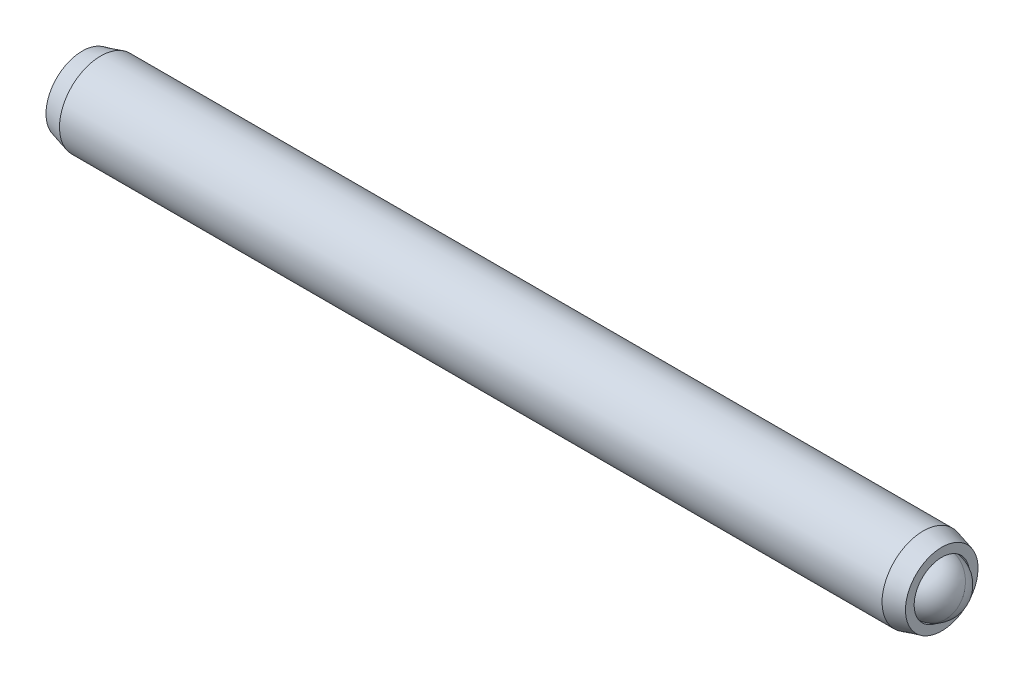
ISO-10303-21;
HEADER;
FILE_DESCRIPTION(('STEP AP214'),'2;1');
FILE_NAME('part.step','',(''),(''),'','','');
FILE_SCHEMA(('AUTOMOTIVE_DESIGN { 1 0 10303 214 1 1 1 1 }'));
ENDSEC;
DATA;
#1=APPLICATION_CONTEXT('core data for automotive mechanical design processes');
#2=APPLICATION_PROTOCOL_DEFINITION('international standard','automotive_design',2000,#1);
#3=PRODUCT_CONTEXT('',#1,'mechanical');
#4=PRODUCT('Part','Part','',(#3));
#5=PRODUCT_RELATED_PRODUCT_CATEGORY('part','',(#4));
#6=PRODUCT_DEFINITION_FORMATION('','',#4);
#7=PRODUCT_DEFINITION_CONTEXT('part definition',#1,'design');
#8=PRODUCT_DEFINITION('design','',#6,#7);
#9=PRODUCT_DEFINITION_SHAPE('','',#8);
#10=(LENGTH_UNIT() NAMED_UNIT(*) SI_UNIT(.MILLI.,.METRE.));
#11=(NAMED_UNIT(*) PLANE_ANGLE_UNIT() SI_UNIT($,.RADIAN.));
#12=(NAMED_UNIT(*) SI_UNIT($,.STERADIAN.) SOLID_ANGLE_UNIT());
#13=UNCERTAINTY_MEASURE_WITH_UNIT(LENGTH_MEASURE(1.E-05),#10,'distance_accuracy_value','');
#14=(GEOMETRIC_REPRESENTATION_CONTEXT(3) GLOBAL_UNCERTAINTY_ASSIGNED_CONTEXT((#13)) GLOBAL_UNIT_ASSIGNED_CONTEXT((#10,
#11,#12)) REPRESENTATION_CONTEXT('',''));
#15=CARTESIAN_POINT('',(0.,0.,0.));
#16=DIRECTION('',(0.,0.,1.));
#17=DIRECTION('',(1.,0.,0.));
#18=AXIS2_PLACEMENT_3D('',#15,#16,#17);
#19=CARTESIAN_POINT('',(-25.4162203856812,1.47543162631791,-0.69225443456844));
#20=DIRECTION('',(-1.,0.,0.));
#21=DIRECTION('',(0.,-1.,0.));
#22=AXIS2_PLACEMENT_3D('',#19,#20,#21);
#23=PLANE('',#22);
#24=DIRECTION('',(0.,0.866025403784438,-0.5));
#25=VECTOR('',#24,1.);
#26=CARTESIAN_POINT('',(-25.4162203856812,1.3484316263179,-2.05790432755285));
#27=LINE('',#26,#25);
#28=CARTESIAN_POINT('',(-25.4162203856812,0.229244126317901,-1.41174112315419));
#29=VERTEX_POINT('',#28);
#30=CARTESIAN_POINT('',(-25.4162203856812,1.47543162631791,-2.13122781173994));
#31=VERTEX_POINT('',#30);
#32=EDGE_CURVE('P0_E164',#29,#31,#27,.T.);
#33=ORIENTED_EDGE('',*,*,#32,.T.);
#34=DIRECTION('',(0.,0.866025403784439,0.5));
#35=VECTOR('',#34,1.);
#36=CARTESIAN_POINT('',(-25.4162203856812,2.59461912631791,-1.48506460734127));
#37=LINE('',#36,#35);
#38=CARTESIAN_POINT('',(-25.4162203856812,2.72161912631791,-1.41174112315419));
#39=VERTEX_POINT('',#38);
#40=EDGE_CURVE('P0_E166',#31,#39,#37,.T.);
#41=ORIENTED_EDGE('',*,*,#40,.T.);
#42=DIRECTION('',(0.,0.,1.));
#43=VECTOR('',#42,1.);
#44=CARTESIAN_POINT('',(-25.4162203856812,2.72161912631791,-0.119414714356858));
#45=LINE('',#44,#43);
#46=CARTESIAN_POINT('',(-25.4162203856812,2.72161912631791,0.0272322540173091));
#47=VERTEX_POINT('',#46);
#48=EDGE_CURVE('P0_E156',#39,#47,#45,.T.);
#49=ORIENTED_EDGE('',*,*,#48,.T.);
#50=DIRECTION('',(0.,-0.866025403784439,0.5));
#51=VECTOR('',#50,1.);
#52=CARTESIAN_POINT('',(-25.4162203856812,1.60243162631791,0.673395458415975));
#53=LINE('',#52,#51);
#54=CARTESIAN_POINT('',(-25.4162203856812,1.47543162631791,0.746718942603059));
#55=VERTEX_POINT('',#54);
#56=EDGE_CURVE('P0_E158',#47,#55,#53,.T.);
#57=ORIENTED_EDGE('',*,*,#56,.T.);
#58=DIRECTION('',(0.,-0.866025403784439,-0.5));
#59=VECTOR('',#58,1.);
#60=CARTESIAN_POINT('',(-25.4162203856812,0.356244126317903,0.100555738204393));
#61=LINE('',#60,#59);
#62=CARTESIAN_POINT('',(-25.4162203856812,0.229244126317901,0.0272322540173094));
#63=VERTEX_POINT('',#62);
#64=EDGE_CURVE('P0_E160',#55,#63,#61,.T.);
#65=ORIENTED_EDGE('',*,*,#64,.T.);
#66=DIRECTION('',(0.,0.,-1.));
#67=VECTOR('',#66,1.);
#68=CARTESIAN_POINT('',(-25.4162203856812,0.229244126317901,-1.26509415478002));
#69=LINE('',#68,#67);
#70=EDGE_CURVE('P0_E162',#63,#29,#69,.T.);
#71=ORIENTED_EDGE('',*,*,#70,.T.);
#72=EDGE_LOOP('',(#33,#41,#49,#57,#65,#71));
#73=FACE_BOUND('',#72,.T.);
#74=CARTESIAN_POINT('',(-25.4162203856812,1.47543162631791,-0.69225443456844));
#75=DIRECTION('',(1.,0.,0.));
#76=DIRECTION('',(0.,1.,0.));
#77=AXIS2_PLACEMENT_3D('',#74,#75,#76);
#78=CIRCLE('',#77,2.0955);
#79=CARTESIAN_POINT('',(-25.4162203856812,3.57093162631791,-0.69225443456844));
#80=VERTEX_POINT('',#79);
#81=EDGE_CURVE('P0_E150',#80,#80,#78,.T.);
#82=ORIENTED_EDGE('',*,*,#81,.F.);
#83=EDGE_LOOP('',(#82));
#84=FACE_BOUND('',#83,.T.);
#85=ADVANCED_FACE('P0_F17',(#73,#84),#23,.T.);
#86=CARTESIAN_POINT('',(-24.3497868674184,1.47543162631791,-0.69225443456844));
#87=DIRECTION('',(1.,0.,0.));
#88=DIRECTION('',(0.,1.,0.));
#89=AXIS2_PLACEMENT_3D('',#86,#87,#88);
#90=CONICAL_SURFACE('',#89,2.38125,0.26179938779915);
#91=ORIENTED_EDGE('',*,*,#81,.T.);
#92=EDGE_LOOP('',(#91));
#93=FACE_BOUND('',#92,.T.);
#94=CARTESIAN_POINT('',(-24.3497868674184,1.47543162631791,-0.69225443456844));
#95=DIRECTION('',(1.,0.,0.));
#96=DIRECTION('',(0.,1.,0.));
#97=AXIS2_PLACEMENT_3D('',#94,#95,#96);
#98=CIRCLE('',#97,2.38125);
#99=CARTESIAN_POINT('',(-24.3497868674184,3.85668162631791,-0.69225443456844));
#100=VERTEX_POINT('',#99);
#101=EDGE_CURVE('P0_E147',#100,#100,#98,.T.);
#102=ORIENTED_EDGE('',*,*,#101,.F.);
#103=EDGE_LOOP('',(#102));
#104=FACE_BOUND('',#103,.T.);
#105=ADVANCED_FACE('P0_F225',(#93,#104),#90,.T.);
#106=CARTESIAN_POINT('',(21.5512155840515,1.47543162631791,-0.69225443456844));
#107=DIRECTION('',(1.,0.,0.));
#108=DIRECTION('',(0.,1.,0.));
#109=AXIS2_PLACEMENT_3D('',#106,#107,#108);
#110=CYLINDRICAL_SURFACE('',#109,2.38125);
#111=ORIENTED_EDGE('',*,*,#101,.T.);
#112=EDGE_LOOP('',(#111));
#113=FACE_BOUND('',#112,.T.);
#114=CARTESIAN_POINT('',(23.174346096056,1.47543162631791,-0.69225443456844));
#115=DIRECTION('',(1.,0.,0.));
#116=DIRECTION('',(0.,1.,0.));
#117=AXIS2_PLACEMENT_3D('',#114,#115,#116);
#118=CIRCLE('',#117,2.38124999999999);
#119=CARTESIAN_POINT('',(23.174346096056,3.85668162631791,-0.69225443456844));
#120=VERTEX_POINT('',#119);
#121=EDGE_CURVE('P0_E144',#120,#120,#118,.T.);
#122=ORIENTED_EDGE('',*,*,#121,.F.);
#123=EDGE_LOOP('',(#122));
#124=FACE_BOUND('',#123,.T.);
#125=ADVANCED_FACE('P0_F231',(#113,#124),#110,.T.);
#126=CARTESIAN_POINT('',(24.2407796143188,1.47543162631791,-0.69225443456844));
#127=DIRECTION('',(-1.,0.,0.));
#128=DIRECTION('',(0.,-1.,0.));
#129=AXIS2_PLACEMENT_3D('',#126,#127,#128);
#130=CONICAL_SURFACE('',#129,2.09549999999999,0.26179938779915);
#131=ORIENTED_EDGE('',*,*,#121,.T.);
#132=EDGE_LOOP('',(#131));
#133=FACE_BOUND('',#132,.T.);
#134=CARTESIAN_POINT('',(24.2407796143188,1.47543162631791,-0.69225443456844));
#135=DIRECTION('',(1.,0.,0.));
#136=DIRECTION('',(0.,1.,0.));
#137=AXIS2_PLACEMENT_3D('',#134,#135,#136);
#138=CIRCLE('',#137,2.09549999999999);
#139=CARTESIAN_POINT('',(24.2407796143188,3.57093162631791,-0.69225443456844));
#140=VERTEX_POINT('',#139);
#141=EDGE_CURVE('P0_E141',#140,#140,#138,.T.);
#142=ORIENTED_EDGE('',*,*,#141,.F.);
#143=EDGE_LOOP('',(#142));
#144=FACE_BOUND('',#143,.T.);
#145=ADVANCED_FACE('P0_F275',(#133,#144),#130,.T.);
#146=CARTESIAN_POINT('',(24.2407796143188,3.57093162631791,-0.69225443456844));
#147=DIRECTION('',(1.,0.,0.));
#148=DIRECTION('',(0.,1.,0.));
#149=AXIS2_PLACEMENT_3D('',#146,#147,#148);
#150=PLANE('',#149);
#151=ORIENTED_EDGE('',*,*,#141,.T.);
#152=EDGE_LOOP('',(#151));
#153=FACE_BOUND('',#152,.T.);
#154=CARTESIAN_POINT('',(24.2407796143188,1.47543162631791,-0.69225443456844));
#155=DIRECTION('',(1.,0.,0.));
#156=DIRECTION('',(0.,1.,0.));
#157=AXIS2_PLACEMENT_3D('',#154,#155,#156);
#158=CIRCLE('',#157,1.59385);
#159=CARTESIAN_POINT('',(24.2407796143188,3.06928162631792,-0.69225443456844));
#160=VERTEX_POINT('',#159);
#161=EDGE_CURVE('P0_E138',#160,#160,#158,.T.);
#162=ORIENTED_EDGE('',*,*,#161,.F.);
#163=EDGE_LOOP('',(#162));
#164=FACE_BOUND('',#163,.T.);
#165=ADVANCED_FACE('P0_F271',(#153,#164),#150,.T.);
#166=CARTESIAN_POINT('',(21.5512155840515,1.47543162631791,-0.69225443456844));
#167=DIRECTION('',(1.,0.,0.));
#168=DIRECTION('',(0.,1.,0.));
#169=AXIS2_PLACEMENT_3D('',#166,#167,#168);
#170=CYLINDRICAL_SURFACE('',#169,1.59385);
#171=ORIENTED_EDGE('',*,*,#161,.T.);
#172=EDGE_LOOP('',(#171));
#173=FACE_BOUND('',#172,.T.);
#174=CARTESIAN_POINT('',(23.1450655840515,1.47543162631791,-0.69225443456844));
#175=DIRECTION('',(1.,0.,0.));
#176=DIRECTION('',(0.,1.,0.));
#177=AXIS2_PLACEMENT_3D('',#174,#175,#176);
#178=CIRCLE('',#177,1.59385);
#179=CARTESIAN_POINT('',(23.1450655840515,3.06928162631792,-0.69225443456844));
#180=VERTEX_POINT('',#179);
#181=EDGE_CURVE('P0_E126',#180,#180,#178,.T.);
#182=ORIENTED_EDGE('',*,*,#181,.F.);
#183=EDGE_LOOP('',(#182));
#184=FACE_BOUND('',#183,.T.);
#185=ADVANCED_FACE('P0_F267',(#173,#184),#170,.F.);
#186=CARTESIAN_POINT('',(21.5512155840515,1.47543162631791,-0.69225443456844));
#187=DIRECTION('',(1.,0.,0.));
#188=DIRECTION('',(0.,1.,0.));
#189=AXIS2_PLACEMENT_3D('',#186,#187,#188);
#190=CONICAL_SURFACE('',#189,0.,0.785398163397451);
#191=ORIENTED_EDGE('',*,*,#181,.T.);
#192=EDGE_LOOP('',(#191));
#193=FACE_BOUND('',#192,.T.);
#194=CARTESIAN_POINT('',(21.5512155840515,1.47543162631791,-0.69225443456844));
#195=VERTEX_POINT('',#194);
#196=VERTEX_LOOP('',#195);
#197=FACE_BOUND('',#196,.T.);
#198=ADVANCED_FACE('P0_F221',(#193,#197),#190,.F.);
#199=CARTESIAN_POINT('',(-22.3682203856812,1.47543162631791,0.453425005854724));
#200=DIRECTION('',(0.,0.5,0.866025403784439));
#201=DIRECTION('',(0.,-0.866025403784439,0.5));
#202=AXIS2_PLACEMENT_3D('',#199,#200,#201);
#203=PLANE('',#202);
#204=DIRECTION('',(-1.,0.,0.));
#205=VECTOR('',#204,1.);
#206=CARTESIAN_POINT('',(-22.3682203856812,1.47543162631791,0.453425005854724));
#207=LINE('',#206,#205);
#208=CARTESIAN_POINT('',(-22.3682203856812,1.47543162631791,0.453425005854724));
#209=VERTEX_POINT('',#208);
#210=CARTESIAN_POINT('',(-25.1622203856812,1.47543162631791,0.453425005854724));
#211=VERTEX_POINT('',#210);
#212=EDGE_CURVE('P0_E124',#209,#211,#207,.T.);
#213=ORIENTED_EDGE('',*,*,#212,.T.);
#214=DIRECTION('',(0.,0.866025403784439,-0.5));
#215=VECTOR('',#214,1.);
#216=CARTESIAN_POINT('',(-25.1622203856812,2.46761912631791,-0.119414714356858));
#217=LINE('',#216,#215);
#218=CARTESIAN_POINT('',(-25.1622203856812,2.46761912631791,-0.119414714356858));
#219=VERTEX_POINT('',#218);
#220=EDGE_CURVE('P0_E26',#211,#219,#217,.T.);
#221=ORIENTED_EDGE('',*,*,#220,.T.);
#222=DIRECTION('',(-1.,0.,0.));
#223=VECTOR('',#222,1.);
#224=CARTESIAN_POINT('',(-22.3682203856812,2.46761912631791,-0.119414714356858));
#225=LINE('',#224,#223);
#226=CARTESIAN_POINT('',(-22.3682203856812,2.46761912631791,-0.119414714356858));
#227=VERTEX_POINT('',#226);
#228=EDGE_CURVE('P0_E90',#227,#219,#225,.T.);
#229=ORIENTED_EDGE('',*,*,#228,.F.);
#230=DIRECTION('',(0.,0.866025403784439,-0.5));
#231=VECTOR('',#230,1.);
#232=CARTESIAN_POINT('',(-22.3682203856812,1.47543162631791,0.453425005854724));
#233=LINE('',#232,#231);
#234=EDGE_CURVE('P0_E94',#209,#227,#233,.T.);
#235=ORIENTED_EDGE('',*,*,#234,.F.);
#236=EDGE_LOOP('',(#213,#221,#229,#235));
#237=FACE_BOUND('',#236,.T.);
#238=ADVANCED_FACE('P0_F92',(#237),#203,.F.);
#239=CARTESIAN_POINT('',(-22.3682203856812,0.483244126317905,-0.119414714356858));
#240=DIRECTION('',(0.,-0.5,0.866025403784439));
#241=DIRECTION('',(0.,-0.866025403784439,-0.5));
#242=AXIS2_PLACEMENT_3D('',#239,#240,#241);
#243=PLANE('',#242);
#244=DIRECTION('',(-1.,0.,0.));
#245=VECTOR('',#244,1.);
#246=CARTESIAN_POINT('',(-22.3682203856812,0.483244126317905,-0.119414714356858));
#247=LINE('',#246,#245);
#248=CARTESIAN_POINT('',(-22.3682203856812,0.483244126317905,-0.119414714356858));
#249=VERTEX_POINT('',#248);
#250=CARTESIAN_POINT('',(-25.1622203856812,0.483244126317905,-0.119414714356858));
#251=VERTEX_POINT('',#250);
#252=EDGE_CURVE('P0_E127',#249,#251,#247,.T.);
#253=ORIENTED_EDGE('',*,*,#252,.T.);
#254=DIRECTION('',(0.,0.866025403784439,0.5));
#255=VECTOR('',#254,1.);
#256=CARTESIAN_POINT('',(-25.1622203856812,1.47543162631791,0.453425005854724));
#257=LINE('',#256,#255);
#258=EDGE_CURVE('P0_E41',#251,#211,#257,.T.);
#259=ORIENTED_EDGE('',*,*,#258,.T.);
#260=ORIENTED_EDGE('',*,*,#212,.F.);
#261=DIRECTION('',(0.,0.866025403784439,0.5));
#262=VECTOR('',#261,1.);
#263=CARTESIAN_POINT('',(-22.3682203856812,0.483244126317905,-0.119414714356858));
#264=LINE('',#263,#262);
#265=EDGE_CURVE('P0_E99',#249,#209,#264,.T.);
#266=ORIENTED_EDGE('',*,*,#265,.F.);
#267=EDGE_LOOP('',(#253,#259,#260,#266));
#268=FACE_BOUND('',#267,.T.);
#269=ADVANCED_FACE('P0_F212',(#268),#243,.F.);
#270=CARTESIAN_POINT('',(-22.3682203856812,0.483244126317905,-1.26509415478002));
#271=DIRECTION('',(0.,-1.,0.));
#272=DIRECTION('',(0.,0.,-1.));
#273=AXIS2_PLACEMENT_3D('',#270,#271,#272);
#274=PLANE('',#273);
#275=DIRECTION('',(-1.,0.,0.));
#276=VECTOR('',#275,1.);
#277=CARTESIAN_POINT('',(-22.3682203856812,0.483244126317905,-1.26509415478002));
#278=LINE('',#277,#276);
#279=CARTESIAN_POINT('',(-22.3682203856812,0.483244126317905,-1.26509415478002));
#280=VERTEX_POINT('',#279);
#281=CARTESIAN_POINT('',(-25.1622203856812,0.483244126317905,-1.26509415478002));
#282=VERTEX_POINT('',#281);
#283=EDGE_CURVE('P0_E129',#280,#282,#278,.T.);
#284=ORIENTED_EDGE('',*,*,#283,.T.);
#285=DIRECTION('',(0.,0.,1.));
#286=VECTOR('',#285,1.);
#287=CARTESIAN_POINT('',(-25.1622203856812,0.483244126317905,-0.119414714356858));
#288=LINE('',#287,#286);
#289=EDGE_CURVE('P0_E171',#282,#251,#288,.T.);
#290=ORIENTED_EDGE('',*,*,#289,.T.);
#291=ORIENTED_EDGE('',*,*,#252,.F.);
#292=DIRECTION('',(0.,0.,1.));
#293=VECTOR('',#292,1.);
#294=CARTESIAN_POINT('',(-22.3682203856812,0.483244126317905,-1.26509415478002));
#295=LINE('',#294,#293);
#296=EDGE_CURVE('P0_E121',#280,#249,#295,.T.);
#297=ORIENTED_EDGE('',*,*,#296,.F.);
#298=EDGE_LOOP('',(#284,#290,#291,#297));
#299=FACE_BOUND('',#298,.T.);
#300=ADVANCED_FACE('P0_F211',(#299),#274,.F.);
#301=CARTESIAN_POINT('',(-22.3682203856812,1.47543162631791,-1.8379338749916));
#302=DIRECTION('',(0.,-0.5,-0.866025403784438));
#303=DIRECTION('',(0.,0.866025403784439,-0.5));
#304=AXIS2_PLACEMENT_3D('',#301,#302,#303);
#305=PLANE('',#304);
#306=DIRECTION('',(-1.,0.,0.));
#307=VECTOR('',#306,1.);
#308=CARTESIAN_POINT('',(-22.3682203856812,1.47543162631791,-1.8379338749916));
#309=LINE('',#308,#307);
#310=CARTESIAN_POINT('',(-22.3682203856812,1.47543162631791,-1.8379338749916));
#311=VERTEX_POINT('',#310);
#312=CARTESIAN_POINT('',(-25.1622203856812,1.47543162631791,-1.8379338749916));
#313=VERTEX_POINT('',#312);
#314=EDGE_CURVE('P0_E132',#311,#313,#309,.T.);
#315=ORIENTED_EDGE('',*,*,#314,.T.);
#316=DIRECTION('',(0.,-0.866025403784439,0.5));
#317=VECTOR('',#316,1.);
#318=CARTESIAN_POINT('',(-25.1622203856812,0.483244126317905,-1.26509415478002));
#319=LINE('',#318,#317);
#320=EDGE_CURVE('P0_E169',#313,#282,#319,.T.);
#321=ORIENTED_EDGE('',*,*,#320,.T.);
#322=ORIENTED_EDGE('',*,*,#283,.F.);
#323=DIRECTION('',(0.,-0.866025403784438,0.5));
#324=VECTOR('',#323,1.);
#325=CARTESIAN_POINT('',(-22.3682203856812,1.47543162631791,-1.8379338749916));
#326=LINE('',#325,#324);
#327=EDGE_CURVE('P0_E118',#311,#280,#326,.T.);
#328=ORIENTED_EDGE('',*,*,#327,.F.);
#329=EDGE_LOOP('',(#315,#321,#322,#328));
#330=FACE_BOUND('',#329,.T.);
#331=ADVANCED_FACE('P0_F208',(#330),#305,.F.);
#332=CARTESIAN_POINT('',(-22.3682203856812,2.46761912631791,-1.26509415478002));
#333=DIRECTION('',(0.,0.5,-0.866025403784439));
#334=DIRECTION('',(0.,0.866025403784439,0.5));
#335=AXIS2_PLACEMENT_3D('',#332,#333,#334);
#336=PLANE('',#335);
#337=DIRECTION('',(-1.,0.,0.));
#338=VECTOR('',#337,1.);
#339=CARTESIAN_POINT('',(-22.3682203856812,2.46761912631791,-1.26509415478002));
#340=LINE('',#339,#338);
#341=CARTESIAN_POINT('',(-22.3682203856812,2.46761912631791,-1.26509415478002));
#342=VERTEX_POINT('',#341);
#343=CARTESIAN_POINT('',(-25.1622203856812,2.46761912631791,-1.26509415478002));
#344=VERTEX_POINT('',#343);
#345=EDGE_CURVE('P0_E98',#342,#344,#340,.T.);
#346=ORIENTED_EDGE('',*,*,#345,.T.);
#347=DIRECTION('',(0.,-0.866025403784439,-0.5));
#348=VECTOR('',#347,1.);
#349=CARTESIAN_POINT('',(-25.1622203856812,1.47543162631791,-1.8379338749916));
#350=LINE('',#349,#348);
#351=EDGE_CURVE('P0_E153',#344,#313,#350,.T.);
#352=ORIENTED_EDGE('',*,*,#351,.T.);
#353=ORIENTED_EDGE('',*,*,#314,.F.);
#354=DIRECTION('',(0.,-0.866025403784439,-0.5));
#355=VECTOR('',#354,1.);
#356=CARTESIAN_POINT('',(-22.3682203856812,2.46761912631791,-1.26509415478002));
#357=LINE('',#356,#355);
#358=EDGE_CURVE('P0_E108',#342,#311,#357,.T.);
#359=ORIENTED_EDGE('',*,*,#358,.F.);
#360=EDGE_LOOP('',(#346,#352,#353,#359));
#361=FACE_BOUND('',#360,.T.);
#362=ADVANCED_FACE('P0_F204',(#361),#336,.F.);
#363=CARTESIAN_POINT('',(-22.3682203856812,2.46761912631791,-0.119414714356858));
#364=DIRECTION('',(0.,1.,0.));
#365=DIRECTION('',(-1.,0.,0.));
#366=AXIS2_PLACEMENT_3D('',#363,#364,#365);
#367=PLANE('',#366);
#368=ORIENTED_EDGE('',*,*,#228,.T.);
#369=DIRECTION('',(0.,0.,-1.));
#370=VECTOR('',#369,1.);
#371=CARTESIAN_POINT('',(-25.1622203856812,2.46761912631791,-1.26509415478002));
#372=LINE('',#371,#370);
#373=EDGE_CURVE('P0_E11',#219,#344,#372,.T.);
#374=ORIENTED_EDGE('',*,*,#373,.T.);
#375=ORIENTED_EDGE('',*,*,#345,.F.);
#376=DIRECTION('',(0.,0.,-1.));
#377=VECTOR('',#376,1.);
#378=CARTESIAN_POINT('',(-22.3682203856812,2.46761912631791,-0.119414714356858));
#379=LINE('',#378,#377);
#380=EDGE_CURVE('P0_E102',#227,#342,#379,.T.);
#381=ORIENTED_EDGE('',*,*,#380,.F.);
#382=EDGE_LOOP('',(#368,#374,#375,#381));
#383=FACE_BOUND('',#382,.T.);
#384=ADVANCED_FACE('P0_F103',(#383),#367,.F.);
#385=CARTESIAN_POINT('',(-22.3682203856812,0.483244126317906,1.02626472606631));
#386=DIRECTION('',(1.,0.,0.));
#387=DIRECTION('',(0.,0.,-1.));
#388=AXIS2_PLACEMENT_3D('',#385,#386,#387);
#389=PLANE('',#388);
#390=ORIENTED_EDGE('',*,*,#234,.T.);
#391=ORIENTED_EDGE('',*,*,#380,.T.);
#392=ORIENTED_EDGE('',*,*,#358,.T.);
#393=ORIENTED_EDGE('',*,*,#327,.T.);
#394=ORIENTED_EDGE('',*,*,#296,.T.);
#395=ORIENTED_EDGE('',*,*,#265,.T.);
#396=EDGE_LOOP('',(#390,#391,#392,#393,#394,#395));
#397=FACE_BOUND('',#396,.T.);
#398=ADVANCED_FACE('P0_F110',(#397),#389,.F.);
#399=CARTESIAN_POINT('',(-25.1622203856812,0.483244126317905,-0.119414714356858));
#400=DIRECTION('',(-0.707106781186557,0.353553390593269,-0.612372435695786));
#401=DIRECTION('',(-0.654653670707967,0.,0.755928946018463));
#402=AXIS2_PLACEMENT_3D('',#399,#400,#401);
#403=PLANE('',#402);
#404=DIRECTION('',(-0.654653670707967,-0.654653670707985,0.377964473009232));
#405=VECTOR('',#404,1.);
#406=CARTESIAN_POINT('',(-24.8787382428241,0.766726269175055,-0.283083205845885));
#407=LINE('',#406,#405);
#408=EDGE_CURVE('P0_E115',#63,#251,#407,.F.);
#409=ORIENTED_EDGE('',*,*,#408,.F.);
#410=ORIENTED_EDGE('',*,*,#64,.F.);
#411=DIRECTION('',(-0.654653670707967,0.,0.755928946018463));
#412=VECTOR('',#411,1.);
#413=CARTESIAN_POINT('',(-24.8787382428241,1.47543162631791,0.12608802287667));
#414=LINE('',#413,#412);
#415=EDGE_CURVE('P0_E21',#211,#55,#414,.T.);
#416=ORIENTED_EDGE('',*,*,#415,.F.);
#417=ORIENTED_EDGE('',*,*,#258,.F.);
#418=EDGE_LOOP('',(#409,#410,#416,#417));
#419=FACE_BOUND('',#418,.T.);
#420=ADVANCED_FACE('P0_F19',(#419),#403,.T.);
#421=CARTESIAN_POINT('',(-25.1622203856812,1.47543162631791,0.453425005854724));
#422=DIRECTION('',(-0.707106781186557,-0.353553390593269,-0.612372435695786));
#423=DIRECTION('',(-0.654653670707967,0.,0.755928946018463));
#424=AXIS2_PLACEMENT_3D('',#421,#422,#423);
#425=PLANE('',#424);
#426=ORIENTED_EDGE('',*,*,#415,.T.);
#427=ORIENTED_EDGE('',*,*,#56,.F.);
#428=DIRECTION('',(-0.654653670707967,0.654653670707985,0.377964473009231));
#429=VECTOR('',#428,1.);
#430=CARTESIAN_POINT('',(-24.8787382428241,2.18413698346076,-0.283083205845885));
#431=LINE('',#430,#429);
#432=EDGE_CURVE('P0_E182',#219,#47,#431,.T.);
#433=ORIENTED_EDGE('',*,*,#432,.F.);
#434=ORIENTED_EDGE('',*,*,#220,.F.);
#435=EDGE_LOOP('',(#426,#427,#433,#434));
#436=FACE_BOUND('',#435,.T.);
#437=ADVANCED_FACE('P0_F196',(#436),#425,.T.);
#438=CARTESIAN_POINT('',(-25.1622203856812,0.483244126317905,-1.26509415478002));
#439=DIRECTION('',(-0.707106781186557,0.707106781186538,0.));
#440=DIRECTION('',(-0.707106781186538,-0.707106781186557,0.));
#441=AXIS2_PLACEMENT_3D('',#438,#439,#440);
#442=PLANE('',#441);
#443=ORIENTED_EDGE('',*,*,#408,.T.);
#444=ORIENTED_EDGE('',*,*,#289,.F.);
#445=DIRECTION('',(-0.654653670707967,-0.654653670707985,-0.377964473009231));
#446=VECTOR('',#445,1.);
#447=CARTESIAN_POINT('',(-24.8787382428241,0.766726269175055,-1.10142566329099));
#448=LINE('',#447,#446);
#449=EDGE_CURVE('P0_E179',#29,#282,#448,.F.);
#450=ORIENTED_EDGE('',*,*,#449,.F.);
#451=ORIENTED_EDGE('',*,*,#70,.F.);
#452=EDGE_LOOP('',(#443,#444,#450,#451));
#453=FACE_BOUND('',#452,.T.);
#454=ADVANCED_FACE('P0_F189',(#453),#442,.T.);
#455=CARTESIAN_POINT('',(-25.1622203856812,2.46761912631791,-0.119414714356858));
#456=DIRECTION('',(-0.707106781186557,-0.707106781186538,0.));
#457=DIRECTION('',(0.707106781186538,-0.707106781186557,0.));
#458=AXIS2_PLACEMENT_3D('',#455,#456,#457);
#459=PLANE('',#458);
#460=ORIENTED_EDGE('',*,*,#432,.T.);
#461=ORIENTED_EDGE('',*,*,#48,.F.);
#462=DIRECTION('',(0.654653670707967,-0.654653670707985,0.377964473009232));
#463=VECTOR('',#462,1.);
#464=CARTESIAN_POINT('',(-25.1622203856812,2.46761912631791,-1.26509415478002));
#465=LINE('',#464,#463);
#466=EDGE_CURVE('P0_E177',#344,#39,#465,.F.);
#467=ORIENTED_EDGE('',*,*,#466,.F.);
#468=ORIENTED_EDGE('',*,*,#373,.F.);
#469=EDGE_LOOP('',(#460,#461,#467,#468));
#470=FACE_BOUND('',#469,.T.);
#471=ADVANCED_FACE('P0_F201',(#470),#459,.T.);
#472=CARTESIAN_POINT('',(-25.1622203856812,1.47543162631791,-1.8379338749916));
#473=DIRECTION('',(-0.707106781186557,0.353553390593269,0.612372435695786));
#474=DIRECTION('',(0.654653670707967,0.,0.755928946018463));
#475=AXIS2_PLACEMENT_3D('',#472,#473,#474);
#476=PLANE('',#475);
#477=ORIENTED_EDGE('',*,*,#449,.T.);
#478=ORIENTED_EDGE('',*,*,#320,.F.);
#479=DIRECTION('',(-0.654653670707967,0.,-0.755928946018463));
#480=VECTOR('',#479,1.);
#481=CARTESIAN_POINT('',(-24.8787382428241,1.47543162631791,-1.51059689201355));
#482=LINE('',#481,#480);
#483=EDGE_CURVE('P0_E175',#31,#313,#482,.F.);
#484=ORIENTED_EDGE('',*,*,#483,.F.);
#485=ORIENTED_EDGE('',*,*,#32,.F.);
#486=EDGE_LOOP('',(#477,#478,#484,#485));
#487=FACE_BOUND('',#486,.T.);
#488=ADVANCED_FACE('P0_F240',(#487),#476,.T.);
#489=CARTESIAN_POINT('',(-25.1622203856812,2.46761912631791,-1.26509415478002));
#490=DIRECTION('',(-0.707106781186557,-0.353553390593269,0.612372435695786));
#491=DIRECTION('',(0.654653670707967,0.,0.755928946018463));
#492=AXIS2_PLACEMENT_3D('',#489,#490,#491);
#493=PLANE('',#492);
#494=ORIENTED_EDGE('',*,*,#466,.T.);
#495=ORIENTED_EDGE('',*,*,#40,.F.);
#496=ORIENTED_EDGE('',*,*,#483,.T.);
#497=ORIENTED_EDGE('',*,*,#351,.F.);
#498=EDGE_LOOP('',(#494,#495,#496,#497));
#499=FACE_BOUND('',#498,.T.);
#500=ADVANCED_FACE('P0_F237',(#499),#493,.T.);
#501=CLOSED_SHELL('',(#85,#105,#125,#145,#165,#185,#198,#238,#269,#300,#331,#362,#384,#398,#420,
#437,#454,#471,#488,#500));
#502=MANIFOLD_SOLID_BREP('P0_B1',#501);
#503=CARTESIAN_POINT('',(23.7962796143188,1.47543162631791,-0.692254434568439));
#504=DIRECTION('',(0.,-0.835151344760725,0.550020209941738));
#505=DIRECTION('',(1.,0.,0.));
#506=AXIS2_PLACEMENT_3D('',#503,#504,#505);
#507=SPHERICAL_SURFACE('',#506,1.5875);
#508=CARTESIAN_POINT('',(23.7962796143188,1.47543162631791,-0.692254434568439));
#509=DIRECTION('',(0.,0.550020209941738,0.835151344760725));
#510=DIRECTION('',(1.,0.,0.));
#511=AXIS2_PLACEMENT_3D('',#508,#509,#510);
#512=CIRCLE('',#511,1.5875);
#513=CARTESIAN_POINT('',(23.7962796143188,2.80123438612556,-1.56541151785095));
#514=VERTEX_POINT('',#513);
#515=CARTESIAN_POINT('',(23.7962796143188,0.149628866510264,0.180902648714069));
#516=VERTEX_POINT('',#515);
#517=EDGE_CURVE('P1_E37',#514,#516,#512,.T.);
#518=ORIENTED_EDGE('',*,*,#517,.F.);
#519=CARTESIAN_POINT('',(23.7962796143188,1.47543162631791,-0.692254434568439));
#520=DIRECTION('',(-1.,0.,0.));
#521=DIRECTION('',(0.,0.550020209941738,0.835151344760725));
#522=AXIS2_PLACEMENT_3D('',#519,#520,#521);
#523=CIRCLE('',#522,1.5875);
#524=EDGE_CURVE('P1_E10',#514,#516,#523,.T.);
#525=ORIENTED_EDGE('',*,*,#524,.T.);
#526=EDGE_LOOP('',(#518,#525));
#527=FACE_BOUND('',#526,.T.);
#528=ADVANCED_FACE('P1_F16',(#527),#507,.T.);
#529=ORIENTED_EDGE('',*,*,#517,.T.);
#530=CARTESIAN_POINT('',(23.7962796143188,1.47543162631791,-0.692254434568439));
#531=DIRECTION('',(-1.,0.,0.));
#532=DIRECTION('',(0.,0.550020209941738,0.835151344760725));
#533=AXIS2_PLACEMENT_3D('',#530,#531,#532);
#534=CIRCLE('',#533,1.5875);
#535=EDGE_CURVE('P1_E23',#516,#514,#534,.T.);
#536=ORIENTED_EDGE('',*,*,#535,.T.);
#537=EDGE_LOOP('',(#529,#536));
#538=FACE_BOUND('',#537,.T.);
#539=ADVANCED_FACE('P1_F36',(#538),#507,.T.);
#540=ORIENTED_EDGE('',*,*,#535,.F.);
#541=EDGE_CURVE('P1_E33',#516,#514,#512,.T.);
#542=ORIENTED_EDGE('',*,*,#541,.T.);
#543=EDGE_LOOP('',(#540,#542));
#544=FACE_BOUND('',#543,.T.);
#545=ADVANCED_FACE('P1_F39',(#544),#507,.T.);
#546=ORIENTED_EDGE('',*,*,#524,.F.);
#547=ORIENTED_EDGE('',*,*,#541,.F.);
#548=EDGE_LOOP('',(#546,#547));
#549=FACE_BOUND('',#548,.T.);
#550=ADVANCED_FACE('P1_F18',(#549),#507,.T.);
#551=CLOSED_SHELL('',(#528,#539,#545,#550));
#552=MANIFOLD_SOLID_BREP('P1_B1',#551);
#553=ADVANCED_BREP_SHAPE_REPRESENTATION('',(#18,#502,#552),#14);
#554=SHAPE_DEFINITION_REPRESENTATION(#9,#553);
ENDSEC;
END-ISO-10303-21;
